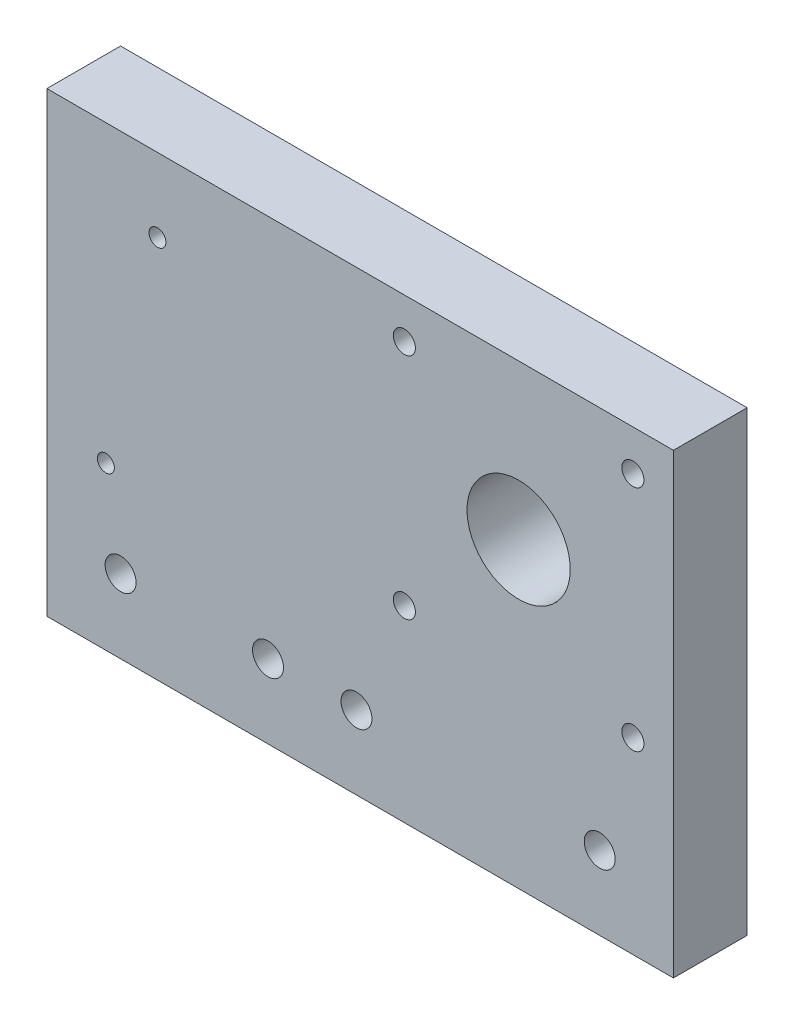
ISO-10303-21;
HEADER;
FILE_DESCRIPTION(('STEP AP214'),'2;1');
FILE_NAME('part.step','',(''),(''),'','','');
FILE_SCHEMA(('AUTOMOTIVE_DESIGN { 1 0 10303 214 1 1 1 1 }'));
ENDSEC;
DATA;
#1=APPLICATION_CONTEXT('core data for automotive mechanical design processes');
#2=APPLICATION_PROTOCOL_DEFINITION('international standard','automotive_design',2000,#1);
#3=PRODUCT_CONTEXT('',#1,'mechanical');
#4=PRODUCT('Part','Part','',(#3));
#5=PRODUCT_RELATED_PRODUCT_CATEGORY('part','',(#4));
#6=PRODUCT_DEFINITION_FORMATION('','',#4);
#7=PRODUCT_DEFINITION_CONTEXT('part definition',#1,'design');
#8=PRODUCT_DEFINITION('design','',#6,#7);
#9=PRODUCT_DEFINITION_SHAPE('','',#8);
#10=(LENGTH_UNIT() NAMED_UNIT(*) SI_UNIT(.MILLI.,.METRE.));
#11=(NAMED_UNIT(*) PLANE_ANGLE_UNIT() SI_UNIT($,.RADIAN.));
#12=(NAMED_UNIT(*) SI_UNIT($,.STERADIAN.) SOLID_ANGLE_UNIT());
#13=UNCERTAINTY_MEASURE_WITH_UNIT(LENGTH_MEASURE(1.E-05),#10,'distance_accuracy_value','');
#14=(GEOMETRIC_REPRESENTATION_CONTEXT(3) GLOBAL_UNCERTAINTY_ASSIGNED_CONTEXT((#13)) GLOBAL_UNIT_ASSIGNED_CONTEXT((#10,
#11,#12)) REPRESENTATION_CONTEXT('',''));
#15=CARTESIAN_POINT('',(0.,0.,0.));
#16=DIRECTION('',(0.,0.,1.));
#17=DIRECTION('',(1.,0.,0.));
#18=AXIS2_PLACEMENT_3D('',#15,#16,#17);
#19=CARTESIAN_POINT('',(0.,0.,10.));
#20=DIRECTION('',(0.,0.,1.));
#21=DIRECTION('',(1.,0.,0.));
#22=AXIS2_PLACEMENT_3D('',#19,#20,#21);
#23=PLANE('',#22);
#24=CARTESIAN_POINT('',(79.5,25.5,10.));
#25=DIRECTION('',(0.,0.,1.));
#26=DIRECTION('',(1.,0.,0.));
#27=AXIS2_PLACEMENT_3D('',#24,#25,#26);
#28=CIRCLE('',#27,1.5);
#29=CARTESIAN_POINT('',(81.,25.5,10.));
#30=VERTEX_POINT('',#29);
#31=EDGE_CURVE('E165',#30,#30,#28,.T.);
#32=ORIENTED_EDGE('',*,*,#31,.F.);
#33=EDGE_LOOP('',(#32));
#34=FACE_BOUND('',#33,.T.);
#35=CARTESIAN_POINT('',(48.5,56.5,10.));
#36=DIRECTION('',(0.,0.,1.));
#37=DIRECTION('',(1.,0.,0.));
#38=AXIS2_PLACEMENT_3D('',#35,#36,#37);
#39=CIRCLE('',#38,1.5);
#40=CARTESIAN_POINT('',(50.,56.5,10.));
#41=VERTEX_POINT('',#40);
#42=EDGE_CURVE('E153',#41,#41,#39,.T.);
#43=ORIENTED_EDGE('',*,*,#42,.F.);
#44=EDGE_LOOP('',(#43));
#45=FACE_BOUND('',#44,.T.);
#46=CARTESIAN_POINT('',(75.,10.,10.));
#47=DIRECTION('',(0.,0.,1.));
#48=DIRECTION('',(1.,0.,0.));
#49=AXIS2_PLACEMENT_3D('',#46,#47,#48);
#50=CIRCLE('',#49,2.1);
#51=CARTESIAN_POINT('',(77.1,10.,10.));
#52=VERTEX_POINT('',#51);
#53=EDGE_CURVE('E141',#52,#52,#50,.T.);
#54=ORIENTED_EDGE('',*,*,#53,.F.);
#55=EDGE_LOOP('',(#54));
#56=FACE_BOUND('',#55,.T.);
#57=CARTESIAN_POINT('',(30.,10.,10.));
#58=DIRECTION('',(0.,0.,1.));
#59=DIRECTION('',(1.,0.,0.));
#60=AXIS2_PLACEMENT_3D('',#57,#58,#59);
#61=CIRCLE('',#60,2.1);
#62=CARTESIAN_POINT('',(32.1,10.,10.));
#63=VERTEX_POINT('',#62);
#64=EDGE_CURVE('E129',#63,#63,#61,.T.);
#65=ORIENTED_EDGE('',*,*,#64,.F.);
#66=EDGE_LOOP('',(#65));
#67=FACE_BOUND('',#66,.T.);
#68=CARTESIAN_POINT('',(15.,52.,10.));
#69=DIRECTION('',(0.,0.,1.));
#70=DIRECTION('',(1.,0.,0.));
#71=AXIS2_PLACEMENT_3D('',#68,#69,#70);
#72=CIRCLE('',#71,1.15);
#73=CARTESIAN_POINT('',(16.15,52.,10.));
#74=VERTEX_POINT('',#73);
#75=EDGE_CURVE('E117',#74,#74,#72,.T.);
#76=ORIENTED_EDGE('',*,*,#75,.F.);
#77=EDGE_LOOP('',(#76));
#78=FACE_BOUND('',#77,.T.);
#79=DIRECTION('',(0.,-1.,0.));
#80=VECTOR('',#79,1.);
#81=CARTESIAN_POINT('',(0.,62.,10.));
#82=LINE('',#81,#80);
#83=CARTESIAN_POINT('',(0.,62.,10.));
#84=VERTEX_POINT('',#83);
#85=CARTESIAN_POINT('',(0.,0.,10.));
#86=VERTEX_POINT('',#85);
#87=EDGE_CURVE('E87',#84,#86,#82,.T.);
#88=ORIENTED_EDGE('',*,*,#87,.T.);
#89=DIRECTION('',(1.,0.,0.));
#90=VECTOR('',#89,1.);
#91=CARTESIAN_POINT('',(0.,0.,10.));
#92=LINE('',#91,#90);
#93=CARTESIAN_POINT('',(85.,0.,10.));
#94=VERTEX_POINT('',#93);
#95=EDGE_CURVE('E82',#86,#94,#92,.T.);
#96=ORIENTED_EDGE('',*,*,#95,.T.);
#97=DIRECTION('',(0.,1.,0.));
#98=VECTOR('',#97,1.);
#99=CARTESIAN_POINT('',(85.,62.,10.));
#100=LINE('',#99,#98);
#101=CARTESIAN_POINT('',(85.,62.,10.));
#102=VERTEX_POINT('',#101);
#103=EDGE_CURVE('E85',#94,#102,#100,.T.);
#104=ORIENTED_EDGE('',*,*,#103,.T.);
#105=DIRECTION('',(-1.,0.,0.));
#106=VECTOR('',#105,1.);
#107=CARTESIAN_POINT('',(0.,62.,10.));
#108=LINE('',#107,#106);
#109=EDGE_CURVE('E52',#102,#84,#108,.T.);
#110=ORIENTED_EDGE('',*,*,#109,.T.);
#111=EDGE_LOOP('',(#88,#96,#104,#110));
#112=FACE_BOUND('',#111,.T.);
#113=CARTESIAN_POINT('',(8.,22.,10.));
#114=DIRECTION('',(0.,0.,1.));
#115=DIRECTION('',(1.,0.,0.));
#116=AXIS2_PLACEMENT_3D('',#113,#114,#115);
#117=CIRCLE('',#116,1.15);
#118=CARTESIAN_POINT('',(9.15,22.,10.));
#119=VERTEX_POINT('',#118);
#120=EDGE_CURVE('E102',#119,#119,#117,.T.);
#121=ORIENTED_EDGE('',*,*,#120,.F.);
#122=EDGE_LOOP('',(#121));
#123=FACE_BOUND('',#122,.T.);
#124=CARTESIAN_POINT('',(10.,10.,10.));
#125=DIRECTION('',(0.,0.,1.));
#126=DIRECTION('',(1.,0.,0.));
#127=AXIS2_PLACEMENT_3D('',#124,#125,#126);
#128=CIRCLE('',#127,2.1);
#129=CARTESIAN_POINT('',(12.1,10.,10.));
#130=VERTEX_POINT('',#129);
#131=EDGE_CURVE('E123',#130,#130,#128,.T.);
#132=ORIENTED_EDGE('',*,*,#131,.F.);
#133=EDGE_LOOP('',(#132));
#134=FACE_BOUND('',#133,.T.);
#135=CARTESIAN_POINT('',(42.,10.,10.));
#136=DIRECTION('',(0.,0.,1.));
#137=DIRECTION('',(1.,0.,0.));
#138=AXIS2_PLACEMENT_3D('',#135,#136,#137);
#139=CIRCLE('',#138,2.1);
#140=CARTESIAN_POINT('',(44.1,10.,10.));
#141=VERTEX_POINT('',#140);
#142=EDGE_CURVE('E135',#141,#141,#139,.T.);
#143=ORIENTED_EDGE('',*,*,#142,.F.);
#144=EDGE_LOOP('',(#143));
#145=FACE_BOUND('',#144,.T.);
#146=CARTESIAN_POINT('',(64.,41.,10.));
#147=DIRECTION('',(0.,0.,1.));
#148=DIRECTION('',(1.,0.,0.));
#149=AXIS2_PLACEMENT_3D('',#146,#147,#148);
#150=CIRCLE('',#149,7.);
#151=CARTESIAN_POINT('',(71.,41.,10.));
#152=VERTEX_POINT('',#151);
#153=EDGE_CURVE('E147',#152,#152,#150,.T.);
#154=ORIENTED_EDGE('',*,*,#153,.F.);
#155=EDGE_LOOP('',(#154));
#156=FACE_BOUND('',#155,.T.);
#157=CARTESIAN_POINT('',(79.5,56.5,10.));
#158=DIRECTION('',(0.,0.,1.));
#159=DIRECTION('',(1.,0.,0.));
#160=AXIS2_PLACEMENT_3D('',#157,#158,#159);
#161=CIRCLE('',#160,1.5);
#162=CARTESIAN_POINT('',(81.,56.5,10.));
#163=VERTEX_POINT('',#162);
#164=EDGE_CURVE('E159',#163,#163,#161,.T.);
#165=ORIENTED_EDGE('',*,*,#164,.F.);
#166=EDGE_LOOP('',(#165));
#167=FACE_BOUND('',#166,.T.);
#168=CARTESIAN_POINT('',(48.5,25.5,10.));
#169=DIRECTION('',(0.,0.,1.));
#170=DIRECTION('',(1.,0.,0.));
#171=AXIS2_PLACEMENT_3D('',#168,#169,#170);
#172=CIRCLE('',#171,1.5);
#173=CARTESIAN_POINT('',(50.,25.5,10.));
#174=VERTEX_POINT('',#173);
#175=EDGE_CURVE('E171',#174,#174,#172,.T.);
#176=ORIENTED_EDGE('',*,*,#175,.F.);
#177=EDGE_LOOP('',(#176));
#178=FACE_BOUND('',#177,.T.);
#179=ADVANCED_FACE('F35',(#34,#45,#56,#67,#78,#112,#123,#134,#145,#156,#167,#178),#23,.T.);
#180=CARTESIAN_POINT('',(0.,0.,0.));
#181=DIRECTION('',(0.,0.,1.));
#182=DIRECTION('',(1.,0.,0.));
#183=AXIS2_PLACEMENT_3D('',#180,#181,#182);
#184=PLANE('',#183);
#185=CARTESIAN_POINT('',(79.5,25.5,0.));
#186=DIRECTION('',(0.,0.,1.));
#187=DIRECTION('',(1.,0.,0.));
#188=AXIS2_PLACEMENT_3D('',#185,#186,#187);
#189=CIRCLE('',#188,1.5);
#190=CARTESIAN_POINT('',(81.,25.5,0.));
#191=VERTEX_POINT('',#190);
#192=EDGE_CURVE('E168',#191,#191,#189,.T.);
#193=ORIENTED_EDGE('',*,*,#192,.T.);
#194=EDGE_LOOP('',(#193));
#195=FACE_BOUND('',#194,.T.);
#196=CARTESIAN_POINT('',(48.5,56.5,0.));
#197=DIRECTION('',(0.,0.,1.));
#198=DIRECTION('',(1.,0.,0.));
#199=AXIS2_PLACEMENT_3D('',#196,#197,#198);
#200=CIRCLE('',#199,1.5);
#201=CARTESIAN_POINT('',(50.,56.5,0.));
#202=VERTEX_POINT('',#201);
#203=EDGE_CURVE('E156',#202,#202,#200,.T.);
#204=ORIENTED_EDGE('',*,*,#203,.T.);
#205=EDGE_LOOP('',(#204));
#206=FACE_BOUND('',#205,.T.);
#207=CARTESIAN_POINT('',(75.,10.,0.));
#208=DIRECTION('',(0.,0.,1.));
#209=DIRECTION('',(1.,0.,0.));
#210=AXIS2_PLACEMENT_3D('',#207,#208,#209);
#211=CIRCLE('',#210,2.1);
#212=CARTESIAN_POINT('',(77.1,10.,0.));
#213=VERTEX_POINT('',#212);
#214=EDGE_CURVE('E144',#213,#213,#211,.T.);
#215=ORIENTED_EDGE('',*,*,#214,.T.);
#216=EDGE_LOOP('',(#215));
#217=FACE_BOUND('',#216,.T.);
#218=CARTESIAN_POINT('',(30.,10.,0.));
#219=DIRECTION('',(0.,0.,1.));
#220=DIRECTION('',(1.,0.,0.));
#221=AXIS2_PLACEMENT_3D('',#218,#219,#220);
#222=CIRCLE('',#221,2.1);
#223=CARTESIAN_POINT('',(32.1,10.,0.));
#224=VERTEX_POINT('',#223);
#225=EDGE_CURVE('E132',#224,#224,#222,.T.);
#226=ORIENTED_EDGE('',*,*,#225,.T.);
#227=EDGE_LOOP('',(#226));
#228=FACE_BOUND('',#227,.T.);
#229=CARTESIAN_POINT('',(15.,52.,0.));
#230=DIRECTION('',(0.,0.,1.));
#231=DIRECTION('',(1.,0.,0.));
#232=AXIS2_PLACEMENT_3D('',#229,#230,#231);
#233=CIRCLE('',#232,1.15);
#234=CARTESIAN_POINT('',(16.15,52.,0.));
#235=VERTEX_POINT('',#234);
#236=EDGE_CURVE('E120',#235,#235,#233,.T.);
#237=ORIENTED_EDGE('',*,*,#236,.T.);
#238=EDGE_LOOP('',(#237));
#239=FACE_BOUND('',#238,.T.);
#240=DIRECTION('',(0.,-1.,0.));
#241=VECTOR('',#240,1.);
#242=CARTESIAN_POINT('',(0.,62.,0.));
#243=LINE('',#242,#241);
#244=CARTESIAN_POINT('',(0.,62.,0.));
#245=VERTEX_POINT('',#244);
#246=CARTESIAN_POINT('',(0.,0.,0.));
#247=VERTEX_POINT('',#246);
#248=EDGE_CURVE('E99',#245,#247,#243,.T.);
#249=ORIENTED_EDGE('',*,*,#248,.F.);
#250=DIRECTION('',(-1.,0.,0.));
#251=VECTOR('',#250,1.);
#252=CARTESIAN_POINT('',(0.,62.,0.));
#253=LINE('',#252,#251);
#254=CARTESIAN_POINT('',(85.,62.,0.));
#255=VERTEX_POINT('',#254);
#256=EDGE_CURVE('E75',#255,#245,#253,.T.);
#257=ORIENTED_EDGE('',*,*,#256,.F.);
#258=DIRECTION('',(0.,1.,0.));
#259=VECTOR('',#258,1.);
#260=CARTESIAN_POINT('',(85.,62.,0.));
#261=LINE('',#260,#259);
#262=CARTESIAN_POINT('',(85.,0.,0.));
#263=VERTEX_POINT('',#262);
#264=EDGE_CURVE('E69',#263,#255,#261,.T.);
#265=ORIENTED_EDGE('',*,*,#264,.F.);
#266=DIRECTION('',(1.,0.,0.));
#267=VECTOR('',#266,1.);
#268=CARTESIAN_POINT('',(0.,0.,0.));
#269=LINE('',#268,#267);
#270=EDGE_CURVE('E91',#247,#263,#269,.T.);
#271=ORIENTED_EDGE('',*,*,#270,.F.);
#272=EDGE_LOOP('',(#249,#257,#265,#271));
#273=FACE_BOUND('',#272,.T.);
#274=CARTESIAN_POINT('',(8.,22.,0.));
#275=DIRECTION('',(0.,0.,1.));
#276=DIRECTION('',(1.,0.,0.));
#277=AXIS2_PLACEMENT_3D('',#274,#275,#276);
#278=CIRCLE('',#277,1.15);
#279=CARTESIAN_POINT('',(9.15,22.,0.));
#280=VERTEX_POINT('',#279);
#281=EDGE_CURVE('E114',#280,#280,#278,.T.);
#282=ORIENTED_EDGE('',*,*,#281,.T.);
#283=EDGE_LOOP('',(#282));
#284=FACE_BOUND('',#283,.T.);
#285=CARTESIAN_POINT('',(10.,10.,0.));
#286=DIRECTION('',(0.,0.,1.));
#287=DIRECTION('',(1.,0.,0.));
#288=AXIS2_PLACEMENT_3D('',#285,#286,#287);
#289=CIRCLE('',#288,2.1);
#290=CARTESIAN_POINT('',(12.1,10.,0.));
#291=VERTEX_POINT('',#290);
#292=EDGE_CURVE('E126',#291,#291,#289,.T.);
#293=ORIENTED_EDGE('',*,*,#292,.T.);
#294=EDGE_LOOP('',(#293));
#295=FACE_BOUND('',#294,.T.);
#296=CARTESIAN_POINT('',(42.,10.,0.));
#297=DIRECTION('',(0.,0.,1.));
#298=DIRECTION('',(1.,0.,0.));
#299=AXIS2_PLACEMENT_3D('',#296,#297,#298);
#300=CIRCLE('',#299,2.1);
#301=CARTESIAN_POINT('',(44.1,10.,0.));
#302=VERTEX_POINT('',#301);
#303=EDGE_CURVE('E138',#302,#302,#300,.T.);
#304=ORIENTED_EDGE('',*,*,#303,.T.);
#305=EDGE_LOOP('',(#304));
#306=FACE_BOUND('',#305,.T.);
#307=CARTESIAN_POINT('',(64.,41.,0.));
#308=DIRECTION('',(0.,0.,1.));
#309=DIRECTION('',(1.,0.,0.));
#310=AXIS2_PLACEMENT_3D('',#307,#308,#309);
#311=CIRCLE('',#310,7.);
#312=CARTESIAN_POINT('',(71.,41.,0.));
#313=VERTEX_POINT('',#312);
#314=EDGE_CURVE('E150',#313,#313,#311,.T.);
#315=ORIENTED_EDGE('',*,*,#314,.T.);
#316=EDGE_LOOP('',(#315));
#317=FACE_BOUND('',#316,.T.);
#318=CARTESIAN_POINT('',(79.5,56.5,0.));
#319=DIRECTION('',(0.,0.,1.));
#320=DIRECTION('',(1.,0.,0.));
#321=AXIS2_PLACEMENT_3D('',#318,#319,#320);
#322=CIRCLE('',#321,1.5);
#323=CARTESIAN_POINT('',(81.,56.5,0.));
#324=VERTEX_POINT('',#323);
#325=EDGE_CURVE('E162',#324,#324,#322,.T.);
#326=ORIENTED_EDGE('',*,*,#325,.T.);
#327=EDGE_LOOP('',(#326));
#328=FACE_BOUND('',#327,.T.);
#329=CARTESIAN_POINT('',(48.5,25.5,0.));
#330=DIRECTION('',(0.,0.,1.));
#331=DIRECTION('',(1.,0.,0.));
#332=AXIS2_PLACEMENT_3D('',#329,#330,#331);
#333=CIRCLE('',#332,1.5);
#334=CARTESIAN_POINT('',(50.,25.5,0.));
#335=VERTEX_POINT('',#334);
#336=EDGE_CURVE('E174',#335,#335,#333,.T.);
#337=ORIENTED_EDGE('',*,*,#336,.T.);
#338=EDGE_LOOP('',(#337));
#339=FACE_BOUND('',#338,.T.);
#340=ADVANCED_FACE('F110',(#195,#206,#217,#228,#239,#273,#284,#295,#306,#317,#328,#339),#184,.F.);
#341=CARTESIAN_POINT('',(0.,62.,10.));
#342=DIRECTION('',(1.,0.,0.));
#343=DIRECTION('',(0.,0.,-1.));
#344=AXIS2_PLACEMENT_3D('',#341,#342,#343);
#345=PLANE('',#344);
#346=ORIENTED_EDGE('',*,*,#248,.T.);
#347=DIRECTION('',(0.,0.,-1.));
#348=VECTOR('',#347,1.);
#349=CARTESIAN_POINT('',(0.,0.,10.));
#350=LINE('',#349,#348);
#351=EDGE_CURVE('E11',#86,#247,#350,.T.);
#352=ORIENTED_EDGE('',*,*,#351,.F.);
#353=ORIENTED_EDGE('',*,*,#87,.F.);
#354=DIRECTION('',(0.,0.,-1.));
#355=VECTOR('',#354,1.);
#356=CARTESIAN_POINT('',(0.,62.,10.));
#357=LINE('',#356,#355);
#358=EDGE_CURVE('E95',#84,#245,#357,.T.);
#359=ORIENTED_EDGE('',*,*,#358,.T.);
#360=EDGE_LOOP('',(#346,#352,#353,#359));
#361=FACE_BOUND('',#360,.T.);
#362=ADVANCED_FACE('F37',(#361),#345,.F.);
#363=CARTESIAN_POINT('',(0.,0.,10.));
#364=DIRECTION('',(0.,1.,0.));
#365=DIRECTION('',(0.,0.,1.));
#366=AXIS2_PLACEMENT_3D('',#363,#364,#365);
#367=PLANE('',#366);
#368=ORIENTED_EDGE('',*,*,#270,.T.);
#369=DIRECTION('',(0.,0.,-1.));
#370=VECTOR('',#369,1.);
#371=CARTESIAN_POINT('',(85.,0.,10.));
#372=LINE('',#371,#370);
#373=EDGE_CURVE('E44',#94,#263,#372,.T.);
#374=ORIENTED_EDGE('',*,*,#373,.F.);
#375=ORIENTED_EDGE('',*,*,#95,.F.);
#376=ORIENTED_EDGE('',*,*,#351,.T.);
#377=EDGE_LOOP('',(#368,#374,#375,#376));
#378=FACE_BOUND('',#377,.T.);
#379=ADVANCED_FACE('F90',(#378),#367,.F.);
#380=CARTESIAN_POINT('',(85.,62.,10.));
#381=DIRECTION('',(-1.,0.,0.));
#382=DIRECTION('',(0.,0.,1.));
#383=AXIS2_PLACEMENT_3D('',#380,#381,#382);
#384=PLANE('',#383);
#385=ORIENTED_EDGE('',*,*,#264,.T.);
#386=DIRECTION('',(0.,0.,-1.));
#387=VECTOR('',#386,1.);
#388=CARTESIAN_POINT('',(85.,62.,10.));
#389=LINE('',#388,#387);
#390=EDGE_CURVE('E92',#102,#255,#389,.T.);
#391=ORIENTED_EDGE('',*,*,#390,.F.);
#392=ORIENTED_EDGE('',*,*,#103,.F.);
#393=ORIENTED_EDGE('',*,*,#373,.T.);
#394=EDGE_LOOP('',(#385,#391,#392,#393));
#395=FACE_BOUND('',#394,.T.);
#396=ADVANCED_FACE('F93',(#395),#384,.F.);
#397=CARTESIAN_POINT('',(0.,62.,10.));
#398=DIRECTION('',(0.,-1.,0.));
#399=DIRECTION('',(0.,0.,-1.));
#400=AXIS2_PLACEMENT_3D('',#397,#398,#399);
#401=PLANE('',#400);
#402=ORIENTED_EDGE('',*,*,#256,.T.);
#403=ORIENTED_EDGE('',*,*,#358,.F.);
#404=ORIENTED_EDGE('',*,*,#109,.F.);
#405=ORIENTED_EDGE('',*,*,#390,.T.);
#406=EDGE_LOOP('',(#402,#403,#404,#405));
#407=FACE_BOUND('',#406,.T.);
#408=ADVANCED_FACE('F107',(#407),#401,.F.);
#409=CARTESIAN_POINT('',(8.,22.,10.));
#410=DIRECTION('',(0.,0.,-1.));
#411=DIRECTION('',(-1.,0.,0.));
#412=AXIS2_PLACEMENT_3D('',#409,#410,#411);
#413=CYLINDRICAL_SURFACE('',#412,1.15);
#414=ORIENTED_EDGE('',*,*,#120,.T.);
#415=EDGE_LOOP('',(#414));
#416=FACE_BOUND('',#415,.T.);
#417=ORIENTED_EDGE('',*,*,#281,.F.);
#418=EDGE_LOOP('',(#417));
#419=FACE_BOUND('',#418,.T.);
#420=ADVANCED_FACE('F194',(#416,#419),#413,.F.);
#421=CARTESIAN_POINT('',(15.,52.,10.));
#422=DIRECTION('',(0.,0.,-1.));
#423=DIRECTION('',(-1.,0.,0.));
#424=AXIS2_PLACEMENT_3D('',#421,#422,#423);
#425=CYLINDRICAL_SURFACE('',#424,1.15);
#426=ORIENTED_EDGE('',*,*,#75,.T.);
#427=EDGE_LOOP('',(#426));
#428=FACE_BOUND('',#427,.T.);
#429=ORIENTED_EDGE('',*,*,#236,.F.);
#430=EDGE_LOOP('',(#429));
#431=FACE_BOUND('',#430,.T.);
#432=ADVANCED_FACE('F240',(#428,#431),#425,.F.);
#433=CARTESIAN_POINT('',(10.,10.,10.));
#434=DIRECTION('',(0.,0.,-1.));
#435=DIRECTION('',(-1.,0.,0.));
#436=AXIS2_PLACEMENT_3D('',#433,#434,#435);
#437=CYLINDRICAL_SURFACE('',#436,2.1);
#438=ORIENTED_EDGE('',*,*,#131,.T.);
#439=EDGE_LOOP('',(#438));
#440=FACE_BOUND('',#439,.T.);
#441=ORIENTED_EDGE('',*,*,#292,.F.);
#442=EDGE_LOOP('',(#441));
#443=FACE_BOUND('',#442,.T.);
#444=ADVANCED_FACE('F248',(#440,#443),#437,.F.);
#445=CARTESIAN_POINT('',(30.,10.,10.));
#446=DIRECTION('',(0.,0.,-1.));
#447=DIRECTION('',(-1.,0.,0.));
#448=AXIS2_PLACEMENT_3D('',#445,#446,#447);
#449=CYLINDRICAL_SURFACE('',#448,2.1);
#450=ORIENTED_EDGE('',*,*,#64,.T.);
#451=EDGE_LOOP('',(#450));
#452=FACE_BOUND('',#451,.T.);
#453=ORIENTED_EDGE('',*,*,#225,.F.);
#454=EDGE_LOOP('',(#453));
#455=FACE_BOUND('',#454,.T.);
#456=ADVANCED_FACE('F256',(#452,#455),#449,.F.);
#457=CARTESIAN_POINT('',(42.,10.,10.));
#458=DIRECTION('',(0.,0.,-1.));
#459=DIRECTION('',(-1.,0.,0.));
#460=AXIS2_PLACEMENT_3D('',#457,#458,#459);
#461=CYLINDRICAL_SURFACE('',#460,2.1);
#462=ORIENTED_EDGE('',*,*,#142,.T.);
#463=EDGE_LOOP('',(#462));
#464=FACE_BOUND('',#463,.T.);
#465=ORIENTED_EDGE('',*,*,#303,.F.);
#466=EDGE_LOOP('',(#465));
#467=FACE_BOUND('',#466,.T.);
#468=ADVANCED_FACE('F265',(#464,#467),#461,.F.);
#469=CARTESIAN_POINT('',(75.,10.,10.));
#470=DIRECTION('',(0.,0.,-1.));
#471=DIRECTION('',(-1.,0.,0.));
#472=AXIS2_PLACEMENT_3D('',#469,#470,#471);
#473=CYLINDRICAL_SURFACE('',#472,2.1);
#474=ORIENTED_EDGE('',*,*,#53,.T.);
#475=EDGE_LOOP('',(#474));
#476=FACE_BOUND('',#475,.T.);
#477=ORIENTED_EDGE('',*,*,#214,.F.);
#478=EDGE_LOOP('',(#477));
#479=FACE_BOUND('',#478,.T.);
#480=ADVANCED_FACE('F274',(#476,#479),#473,.F.);
#481=CARTESIAN_POINT('',(64.,41.,10.));
#482=DIRECTION('',(0.,0.,-1.));
#483=DIRECTION('',(-1.,0.,0.));
#484=AXIS2_PLACEMENT_3D('',#481,#482,#483);
#485=CYLINDRICAL_SURFACE('',#484,7.);
#486=ORIENTED_EDGE('',*,*,#153,.T.);
#487=EDGE_LOOP('',(#486));
#488=FACE_BOUND('',#487,.T.);
#489=ORIENTED_EDGE('',*,*,#314,.F.);
#490=EDGE_LOOP('',(#489));
#491=FACE_BOUND('',#490,.T.);
#492=ADVANCED_FACE('F283',(#488,#491),#485,.F.);
#493=CARTESIAN_POINT('',(48.5,56.5,10.));
#494=DIRECTION('',(0.,0.,-1.));
#495=DIRECTION('',(-1.,0.,0.));
#496=AXIS2_PLACEMENT_3D('',#493,#494,#495);
#497=CYLINDRICAL_SURFACE('',#496,1.5);
#498=ORIENTED_EDGE('',*,*,#42,.T.);
#499=EDGE_LOOP('',(#498));
#500=FACE_BOUND('',#499,.T.);
#501=ORIENTED_EDGE('',*,*,#203,.F.);
#502=EDGE_LOOP('',(#501));
#503=FACE_BOUND('',#502,.T.);
#504=ADVANCED_FACE('F292',(#500,#503),#497,.F.);
#505=CARTESIAN_POINT('',(79.5,56.5,10.));
#506=DIRECTION('',(0.,0.,-1.));
#507=DIRECTION('',(-1.,0.,0.));
#508=AXIS2_PLACEMENT_3D('',#505,#506,#507);
#509=CYLINDRICAL_SURFACE('',#508,1.5);
#510=ORIENTED_EDGE('',*,*,#164,.T.);
#511=EDGE_LOOP('',(#510));
#512=FACE_BOUND('',#511,.T.);
#513=ORIENTED_EDGE('',*,*,#325,.F.);
#514=EDGE_LOOP('',(#513));
#515=FACE_BOUND('',#514,.T.);
#516=ADVANCED_FACE('F301',(#512,#515),#509,.F.);
#517=CARTESIAN_POINT('',(79.5,25.5,10.));
#518=DIRECTION('',(0.,0.,-1.));
#519=DIRECTION('',(-1.,0.,0.));
#520=AXIS2_PLACEMENT_3D('',#517,#518,#519);
#521=CYLINDRICAL_SURFACE('',#520,1.5);
#522=ORIENTED_EDGE('',*,*,#31,.T.);
#523=EDGE_LOOP('',(#522));
#524=FACE_BOUND('',#523,.T.);
#525=ORIENTED_EDGE('',*,*,#192,.F.);
#526=EDGE_LOOP('',(#525));
#527=FACE_BOUND('',#526,.T.);
#528=ADVANCED_FACE('F310',(#524,#527),#521,.F.);
#529=CARTESIAN_POINT('',(48.5,25.5,10.));
#530=DIRECTION('',(0.,0.,-1.));
#531=DIRECTION('',(-1.,0.,0.));
#532=AXIS2_PLACEMENT_3D('',#529,#530,#531);
#533=CYLINDRICAL_SURFACE('',#532,1.5);
#534=ORIENTED_EDGE('',*,*,#175,.T.);
#535=EDGE_LOOP('',(#534));
#536=FACE_BOUND('',#535,.T.);
#537=ORIENTED_EDGE('',*,*,#336,.F.);
#538=EDGE_LOOP('',(#537));
#539=FACE_BOUND('',#538,.T.);
#540=ADVANCED_FACE('F180',(#536,#539),#533,.F.);
#541=CLOSED_SHELL('',(#179,#340,#362,#379,#396,#408,#420,#432,#444,#456,#468,#480,#492,#504,
#516,#528,#540));
#542=MANIFOLD_SOLID_BREP('B2',#541);
#543=ADVANCED_BREP_SHAPE_REPRESENTATION('',(#18,#542),#14);
#544=SHAPE_DEFINITION_REPRESENTATION(#9,#543);
ENDSEC;
END-ISO-10303-21;
